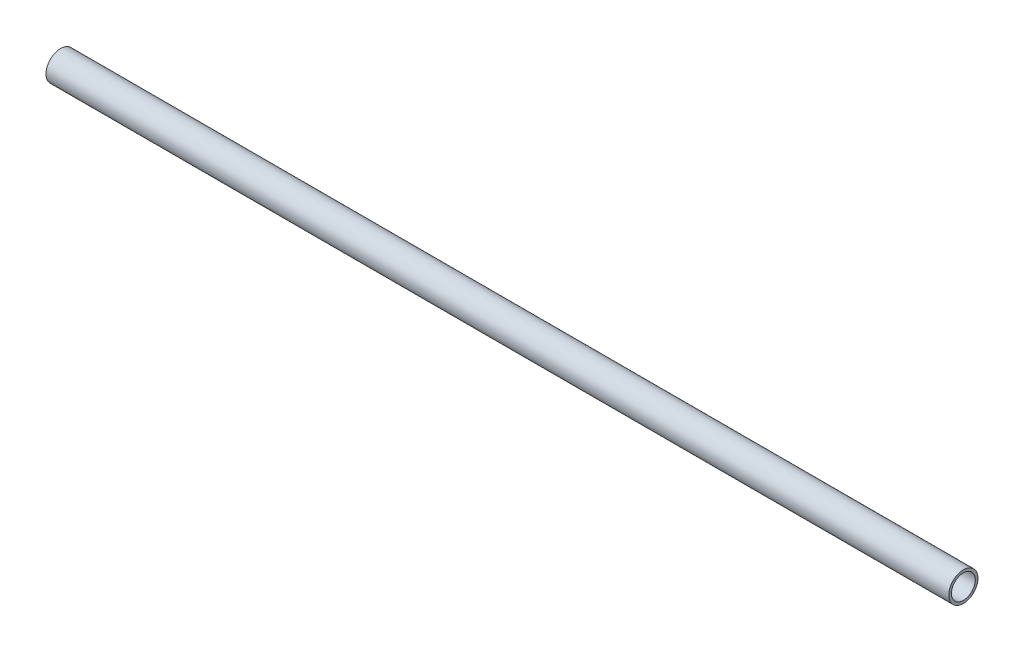
ISO-10303-21;
HEADER;
FILE_DESCRIPTION(('STEP AP214'),'2;1');
FILE_NAME('part.step','',(''),(''),'','','');
FILE_SCHEMA(('AUTOMOTIVE_DESIGN { 1 0 10303 214 1 1 1 1 }'));
ENDSEC;
DATA;
#1=APPLICATION_CONTEXT('core data for automotive mechanical design processes');
#2=APPLICATION_PROTOCOL_DEFINITION('international standard','automotive_design',2000,#1);
#3=PRODUCT_CONTEXT('',#1,'mechanical');
#4=PRODUCT('Part','Part','',(#3));
#5=PRODUCT_RELATED_PRODUCT_CATEGORY('part','',(#4));
#6=PRODUCT_DEFINITION_FORMATION('','',#4);
#7=PRODUCT_DEFINITION_CONTEXT('part definition',#1,'design');
#8=PRODUCT_DEFINITION('design','',#6,#7);
#9=PRODUCT_DEFINITION_SHAPE('','',#8);
#10=(LENGTH_UNIT() NAMED_UNIT(*) SI_UNIT(.MILLI.,.METRE.));
#11=(NAMED_UNIT(*) PLANE_ANGLE_UNIT() SI_UNIT($,.RADIAN.));
#12=(NAMED_UNIT(*) SI_UNIT($,.STERADIAN.) SOLID_ANGLE_UNIT());
#13=UNCERTAINTY_MEASURE_WITH_UNIT(LENGTH_MEASURE(1.E-05),#10,'distance_accuracy_value','');
#14=(GEOMETRIC_REPRESENTATION_CONTEXT(3) GLOBAL_UNCERTAINTY_ASSIGNED_CONTEXT((#13)) GLOBAL_UNIT_ASSIGNED_CONTEXT((#10,
#11,#12)) REPRESENTATION_CONTEXT('',''));
#15=CARTESIAN_POINT('',(0.,0.,0.));
#16=DIRECTION('',(0.,0.,1.));
#17=DIRECTION('',(1.,0.,0.));
#18=AXIS2_PLACEMENT_3D('',#15,#16,#17);
#19=CARTESIAN_POINT('',(0.,0.,0.));
#20=DIRECTION('',(-1.,0.,0.));
#21=DIRECTION('',(0.,0.,1.));
#22=AXIS2_PLACEMENT_3D('',#19,#20,#21);
#23=CYLINDRICAL_SURFACE('',#22,6.4643);
#24=CARTESIAN_POINT('',(0.,0.,0.));
#25=DIRECTION('',(1.,0.,0.));
#26=DIRECTION('',(0.,0.,-1.));
#27=AXIS2_PLACEMENT_3D('',#24,#25,#26);
#28=CIRCLE('',#27,6.4643);
#29=CARTESIAN_POINT('',(0.,0.,-6.4643));
#30=VERTEX_POINT('',#29);
#31=EDGE_CURVE('E49',#30,#30,#28,.T.);
#32=ORIENTED_EDGE('',*,*,#31,.T.);
#33=EDGE_LOOP('',(#32));
#34=FACE_BOUND('',#33,.T.);
#35=CARTESIAN_POINT('',(-489.896,0.,0.));
#36=DIRECTION('',(1.,0.,0.));
#37=DIRECTION('',(0.,0.,-1.));
#38=AXIS2_PLACEMENT_3D('',#35,#36,#37);
#39=CIRCLE('',#38,6.4643);
#40=CARTESIAN_POINT('',(-489.896,0.,-6.4643));
#41=VERTEX_POINT('',#40);
#42=EDGE_CURVE('E55',#41,#41,#39,.T.);
#43=ORIENTED_EDGE('',*,*,#42,.F.);
#44=EDGE_LOOP('',(#43));
#45=FACE_BOUND('',#44,.T.);
#46=ADVANCED_FACE('F42',(#34,#45),#23,.F.);
#47=CARTESIAN_POINT('',(0.,0.,0.));
#48=DIRECTION('',(-1.,0.,0.));
#49=DIRECTION('',(0.,0.,1.));
#50=AXIS2_PLACEMENT_3D('',#47,#48,#49);
#51=CYLINDRICAL_SURFACE('',#50,7.9375);
#52=CARTESIAN_POINT('',(0.,0.,0.));
#53=DIRECTION('',(1.,0.,0.));
#54=DIRECTION('',(0.,0.,-1.));
#55=AXIS2_PLACEMENT_3D('',#52,#53,#54);
#56=CIRCLE('',#55,7.9375);
#57=CARTESIAN_POINT('',(0.,0.,-7.9375));
#58=VERTEX_POINT('',#57);
#59=EDGE_CURVE('E11',#58,#58,#56,.T.);
#60=ORIENTED_EDGE('',*,*,#59,.F.);
#61=EDGE_LOOP('',(#60));
#62=FACE_BOUND('',#61,.T.);
#63=CARTESIAN_POINT('',(-489.896,0.,0.));
#64=DIRECTION('',(1.,0.,0.));
#65=DIRECTION('',(0.,0.,-1.));
#66=AXIS2_PLACEMENT_3D('',#63,#64,#65);
#67=CIRCLE('',#66,7.9375);
#68=CARTESIAN_POINT('',(-489.896,0.,-7.9375));
#69=VERTEX_POINT('',#68);
#70=EDGE_CURVE('E45',#69,#69,#67,.T.);
#71=ORIENTED_EDGE('',*,*,#70,.T.);
#72=EDGE_LOOP('',(#71));
#73=FACE_BOUND('',#72,.T.);
#74=ADVANCED_FACE('F62',(#62,#73),#51,.T.);
#75=CARTESIAN_POINT('',(0.,0.,0.));
#76=DIRECTION('',(1.,0.,0.));
#77=DIRECTION('',(0.,0.,-1.));
#78=AXIS2_PLACEMENT_3D('',#75,#76,#77);
#79=PLANE('',#78);
#80=ORIENTED_EDGE('',*,*,#31,.F.);
#81=EDGE_LOOP('',(#80));
#82=FACE_BOUND('',#81,.T.);
#83=ORIENTED_EDGE('',*,*,#59,.T.);
#84=EDGE_LOOP('',(#83));
#85=FACE_BOUND('',#84,.T.);
#86=ADVANCED_FACE('F66',(#82,#85),#79,.T.);
#87=CARTESIAN_POINT('',(-489.896,0.,0.));
#88=DIRECTION('',(1.,0.,0.));
#89=DIRECTION('',(0.,0.,-1.));
#90=AXIS2_PLACEMENT_3D('',#87,#88,#89);
#91=PLANE('',#90);
#92=ORIENTED_EDGE('',*,*,#42,.T.);
#93=EDGE_LOOP('',(#92));
#94=FACE_BOUND('',#93,.T.);
#95=ORIENTED_EDGE('',*,*,#70,.F.);
#96=EDGE_LOOP('',(#95));
#97=FACE_BOUND('',#96,.T.);
#98=ADVANCED_FACE('F64',(#94,#97),#91,.F.);
#99=CLOSED_SHELL('',(#46,#74,#86,#98));
#100=MANIFOLD_SOLID_BREP('B2',#99);
#101=ADVANCED_BREP_SHAPE_REPRESENTATION('',(#18,#100),#14);
#102=SHAPE_DEFINITION_REPRESENTATION(#9,#101);
ENDSEC;
END-ISO-10303-21;
